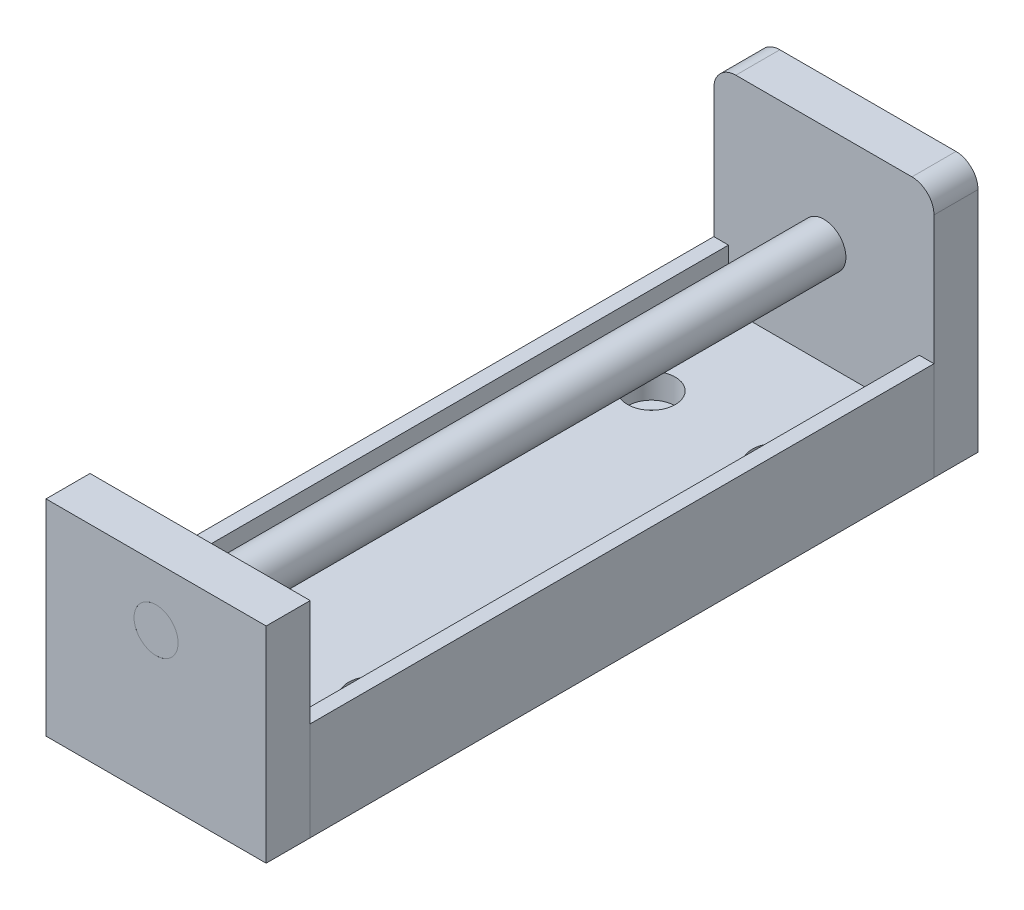
ISO-10303-21;
HEADER;
FILE_DESCRIPTION(('STEP AP214'),'2;1');
FILE_NAME('part.step','',(''),(''),'','','');
FILE_SCHEMA(('AUTOMOTIVE_DESIGN { 1 0 10303 214 1 1 1 1 }'));
ENDSEC;
DATA;
#1=APPLICATION_CONTEXT('core data for automotive mechanical design processes');
#2=APPLICATION_PROTOCOL_DEFINITION('international standard','automotive_design',2000,#1);
#3=PRODUCT_CONTEXT('',#1,'mechanical');
#4=PRODUCT('Part','Part','',(#3));
#5=PRODUCT_RELATED_PRODUCT_CATEGORY('part','',(#4));
#6=PRODUCT_DEFINITION_FORMATION('','',#4);
#7=PRODUCT_DEFINITION_CONTEXT('part definition',#1,'design');
#8=PRODUCT_DEFINITION('design','',#6,#7);
#9=PRODUCT_DEFINITION_SHAPE('','',#8);
#10=(LENGTH_UNIT() NAMED_UNIT(*) SI_UNIT(.MILLI.,.METRE.));
#11=(NAMED_UNIT(*) PLANE_ANGLE_UNIT() SI_UNIT($,.RADIAN.));
#12=(NAMED_UNIT(*) SI_UNIT($,.STERADIAN.) SOLID_ANGLE_UNIT());
#13=UNCERTAINTY_MEASURE_WITH_UNIT(LENGTH_MEASURE(1.E-05),#10,'distance_accuracy_value','');
#14=(GEOMETRIC_REPRESENTATION_CONTEXT(3) GLOBAL_UNCERTAINTY_ASSIGNED_CONTEXT((#13)) GLOBAL_UNIT_ASSIGNED_CONTEXT((#10,
#11,#12)) REPRESENTATION_CONTEXT('',''));
#15=CARTESIAN_POINT('',(0.,0.,0.));
#16=DIRECTION('',(0.,0.,1.));
#17=DIRECTION('',(1.,0.,0.));
#18=AXIS2_PLACEMENT_3D('',#15,#16,#17);
#19=CARTESIAN_POINT('',(0.,0.,6.51471862576143));
#20=DIRECTION('',(0.,0.,1.));
#21=DIRECTION('',(1.,0.,0.));
#22=AXIS2_PLACEMENT_3D('',#19,#20,#21);
#23=CYLINDRICAL_SURFACE('',#22,3.);
#24=CARTESIAN_POINT('',(0.,0.,15.));
#25=DIRECTION('',(0.,0.,1.));
#26=DIRECTION('',(1.,0.,0.));
#27=AXIS2_PLACEMENT_3D('',#24,#25,#26);
#28=CIRCLE('',#27,3.);
#29=CARTESIAN_POINT('',(3.,0.,15.));
#30=VERTEX_POINT('',#29);
#31=EDGE_CURVE('E11',#30,#30,#28,.F.);
#32=ORIENTED_EDGE('',*,*,#31,.F.);
#33=EDGE_LOOP('',(#32));
#34=FACE_BOUND('',#33,.T.);
#35=CARTESIAN_POINT('',(0.,0.,112.));
#36=DIRECTION('',(0.,0.,-1.));
#37=DIRECTION('',(-1.,0.,0.));
#38=AXIS2_PLACEMENT_3D('',#35,#36,#37);
#39=CIRCLE('',#38,3.);
#40=CARTESIAN_POINT('',(-3.,0.,112.));
#41=VERTEX_POINT('',#40);
#42=EDGE_CURVE('E48',#41,#41,#39,.T.);
#43=ORIENTED_EDGE('',*,*,#42,.T.);
#44=EDGE_LOOP('',(#43));
#45=FACE_BOUND('',#44,.T.);
#46=ADVANCED_FACE('F42',(#34,#45),#23,.T.);
#47=CARTESIAN_POINT('',(0.,0.,15.));
#48=DIRECTION('',(0.,0.,1.));
#49=DIRECTION('',(1.,0.,0.));
#50=AXIS2_PLACEMENT_3D('',#47,#48,#49);
#51=PLANE('',#50);
#52=ORIENTED_EDGE('',*,*,#31,.T.);
#53=EDGE_LOOP('',(#52));
#54=FACE_BOUND('',#53,.T.);
#55=ADVANCED_FACE('F57',(#54),#51,.F.);
#56=CARTESIAN_POINT('',(0.,0.,112.));
#57=DIRECTION('',(0.,0.,-1.));
#58=DIRECTION('',(-1.,0.,0.));
#59=AXIS2_PLACEMENT_3D('',#56,#57,#58);
#60=PLANE('',#59);
#61=ORIENTED_EDGE('',*,*,#42,.F.);
#62=EDGE_LOOP('',(#61));
#63=FACE_BOUND('',#62,.T.);
#64=ADVANCED_FACE('F55',(#63),#60,.F.);
#65=CLOSED_SHELL('',(#46,#55,#64));
#66=MANIFOLD_SOLID_BREP('B2',#65);
#67=CARTESIAN_POINT('',(-15.,-20.,112.));
#68=DIRECTION('',(1.,0.,0.));
#69=DIRECTION('',(0.,0.,-1.));
#70=AXIS2_PLACEMENT_3D('',#67,#68,#69);
#71=PLANE('',#70);
#72=DIRECTION('',(0.,-1.,0.));
#73=VECTOR('',#72,1.);
#74=CARTESIAN_POINT('',(-15.,-20.,106.));
#75=LINE('',#74,#73);
#76=CARTESIAN_POINT('',(-15.,8.,106.));
#77=VERTEX_POINT('',#76);
#78=CARTESIAN_POINT('',(-15.,-20.,106.));
#79=VERTEX_POINT('',#78);
#80=EDGE_CURVE('E158',#77,#79,#75,.T.);
#81=ORIENTED_EDGE('',*,*,#80,.T.);
#82=DIRECTION('',(0.,0.,-1.));
#83=VECTOR('',#82,1.);
#84=CARTESIAN_POINT('',(-15.,-20.,112.));
#85=LINE('',#84,#83);
#86=CARTESIAN_POINT('',(-15.,-20.,112.));
#87=VERTEX_POINT('',#86);
#88=EDGE_CURVE('E40',#87,#79,#85,.T.);
#89=ORIENTED_EDGE('',*,*,#88,.F.);
#90=DIRECTION('',(0.,-1.,0.));
#91=VECTOR('',#90,1.);
#92=CARTESIAN_POINT('',(-15.,-20.,112.));
#93=LINE('',#92,#91);
#94=CARTESIAN_POINT('',(-15.,8.,112.));
#95=VERTEX_POINT('',#94);
#96=EDGE_CURVE('E145',#95,#87,#93,.T.);
#97=ORIENTED_EDGE('',*,*,#96,.F.);
#98=DIRECTION('',(0.,0.,-1.));
#99=VECTOR('',#98,1.);
#100=CARTESIAN_POINT('',(-15.,8.,112.));
#101=LINE('',#100,#99);
#102=EDGE_CURVE('E154',#95,#77,#101,.T.);
#103=ORIENTED_EDGE('',*,*,#102,.T.);
#104=EDGE_LOOP('',(#81,#89,#97,#103));
#105=FACE_BOUND('',#104,.T.);
#106=ADVANCED_FACE('F93',(#105),#71,.F.);
#107=CARTESIAN_POINT('',(-15.,-20.,112.));
#108=DIRECTION('',(0.,1.,0.));
#109=DIRECTION('',(0.,0.,1.));
#110=AXIS2_PLACEMENT_3D('',#107,#108,#109);
#111=PLANE('',#110);
#112=DIRECTION('',(1.,0.,0.));
#113=VECTOR('',#112,1.);
#114=CARTESIAN_POINT('',(-15.,-20.,106.));
#115=LINE('',#114,#113);
#116=CARTESIAN_POINT('',(15.,-20.,106.));
#117=VERTEX_POINT('',#116);
#118=EDGE_CURVE('E149',#79,#117,#115,.T.);
#119=ORIENTED_EDGE('',*,*,#118,.T.);
#120=DIRECTION('',(0.,0.,-1.));
#121=VECTOR('',#120,1.);
#122=CARTESIAN_POINT('',(15.,-20.,112.));
#123=LINE('',#122,#121);
#124=CARTESIAN_POINT('',(15.,-20.,112.));
#125=VERTEX_POINT('',#124);
#126=EDGE_CURVE('E102',#125,#117,#123,.T.);
#127=ORIENTED_EDGE('',*,*,#126,.F.);
#128=DIRECTION('',(1.,0.,0.));
#129=VECTOR('',#128,1.);
#130=CARTESIAN_POINT('',(-15.,-20.,112.));
#131=LINE('',#130,#129);
#132=EDGE_CURVE('E140',#87,#125,#131,.T.);
#133=ORIENTED_EDGE('',*,*,#132,.F.);
#134=ORIENTED_EDGE('',*,*,#88,.T.);
#135=EDGE_LOOP('',(#119,#127,#133,#134));
#136=FACE_BOUND('',#135,.T.);
#137=ADVANCED_FACE('F148',(#136),#111,.F.);
#138=CARTESIAN_POINT('',(15.,-20.,112.));
#139=DIRECTION('',(-1.,0.,0.));
#140=DIRECTION('',(0.,0.,1.));
#141=AXIS2_PLACEMENT_3D('',#138,#139,#140);
#142=PLANE('',#141);
#143=DIRECTION('',(0.,1.,0.));
#144=VECTOR('',#143,1.);
#145=CARTESIAN_POINT('',(15.,-20.,106.));
#146=LINE('',#145,#144);
#147=CARTESIAN_POINT('',(15.,8.,106.));
#148=VERTEX_POINT('',#147);
#149=EDGE_CURVE('E127',#117,#148,#146,.T.);
#150=ORIENTED_EDGE('',*,*,#149,.T.);
#151=DIRECTION('',(0.,0.,-1.));
#152=VECTOR('',#151,1.);
#153=CARTESIAN_POINT('',(15.,8.,112.));
#154=LINE('',#153,#152);
#155=CARTESIAN_POINT('',(15.,8.,112.));
#156=VERTEX_POINT('',#155);
#157=EDGE_CURVE('E150',#156,#148,#154,.T.);
#158=ORIENTED_EDGE('',*,*,#157,.F.);
#159=DIRECTION('',(0.,1.,0.));
#160=VECTOR('',#159,1.);
#161=CARTESIAN_POINT('',(15.,-20.,112.));
#162=LINE('',#161,#160);
#163=EDGE_CURVE('E143',#125,#156,#162,.T.);
#164=ORIENTED_EDGE('',*,*,#163,.F.);
#165=ORIENTED_EDGE('',*,*,#126,.T.);
#166=EDGE_LOOP('',(#150,#158,#164,#165));
#167=FACE_BOUND('',#166,.T.);
#168=ADVANCED_FACE('F152',(#167),#142,.F.);
#169=CARTESIAN_POINT('',(-15.,8.,112.));
#170=DIRECTION('',(0.,-1.,0.));
#171=DIRECTION('',(0.,0.,-1.));
#172=AXIS2_PLACEMENT_3D('',#169,#170,#171);
#173=PLANE('',#172);
#174=DIRECTION('',(-1.,0.,0.));
#175=VECTOR('',#174,1.);
#176=CARTESIAN_POINT('',(-15.,8.,106.));
#177=LINE('',#176,#175);
#178=EDGE_CURVE('E133',#148,#77,#177,.T.);
#179=ORIENTED_EDGE('',*,*,#178,.T.);
#180=ORIENTED_EDGE('',*,*,#102,.F.);
#181=DIRECTION('',(-1.,0.,0.));
#182=VECTOR('',#181,1.);
#183=CARTESIAN_POINT('',(-15.,8.,112.));
#184=LINE('',#183,#182);
#185=EDGE_CURVE('E110',#156,#95,#184,.T.);
#186=ORIENTED_EDGE('',*,*,#185,.F.);
#187=ORIENTED_EDGE('',*,*,#157,.T.);
#188=EDGE_LOOP('',(#179,#180,#186,#187));
#189=FACE_BOUND('',#188,.T.);
#190=ADVANCED_FACE('F165',(#189),#173,.F.);
#191=CARTESIAN_POINT('',(0.,0.,112.));
#192=DIRECTION('',(0.,0.,-1.));
#193=DIRECTION('',(-1.,0.,0.));
#194=AXIS2_PLACEMENT_3D('',#191,#192,#193);
#195=PLANE('',#194);
#196=CARTESIAN_POINT('',(0.,0.,112.));
#197=DIRECTION('',(0.,0.,1.));
#198=DIRECTION('',(1.,0.,0.));
#199=AXIS2_PLACEMENT_3D('',#196,#197,#198);
#200=CIRCLE('',#199,3.);
#201=CARTESIAN_POINT('',(3.,0.,112.));
#202=VERTEX_POINT('',#201);
#203=EDGE_CURVE('E171',#202,#202,#200,.T.);
#204=ORIENTED_EDGE('',*,*,#203,.F.);
#205=EDGE_LOOP('',(#204));
#206=FACE_BOUND('',#205,.T.);
#207=ORIENTED_EDGE('',*,*,#96,.T.);
#208=ORIENTED_EDGE('',*,*,#132,.T.);
#209=ORIENTED_EDGE('',*,*,#163,.T.);
#210=ORIENTED_EDGE('',*,*,#185,.T.);
#211=EDGE_LOOP('',(#207,#208,#209,#210));
#212=FACE_BOUND('',#211,.T.);
#213=ADVANCED_FACE('F141',(#206,#212),#195,.F.);
#214=CARTESIAN_POINT('',(0.,0.,106.));
#215=DIRECTION('',(0.,0.,-1.));
#216=DIRECTION('',(-1.,0.,0.));
#217=AXIS2_PLACEMENT_3D('',#214,#215,#216);
#218=PLANE('',#217);
#219=CARTESIAN_POINT('',(0.,0.,106.));
#220=DIRECTION('',(0.,0.,-1.));
#221=DIRECTION('',(-1.,0.,0.));
#222=AXIS2_PLACEMENT_3D('',#219,#220,#221);
#223=CIRCLE('',#222,3.);
#224=CARTESIAN_POINT('',(-3.,0.,106.));
#225=VERTEX_POINT('',#224);
#226=EDGE_CURVE('E96',#225,#225,#223,.T.);
#227=ORIENTED_EDGE('',*,*,#226,.F.);
#228=EDGE_LOOP('',(#227));
#229=FACE_BOUND('',#228,.T.);
#230=ORIENTED_EDGE('',*,*,#80,.F.);
#231=ORIENTED_EDGE('',*,*,#178,.F.);
#232=ORIENTED_EDGE('',*,*,#149,.F.);
#233=ORIENTED_EDGE('',*,*,#118,.F.);
#234=EDGE_LOOP('',(#230,#231,#232,#233));
#235=FACE_BOUND('',#234,.T.);
#236=ADVANCED_FACE('F168',(#229,#235),#218,.T.);
#237=CARTESIAN_POINT('',(0.,0.,15.));
#238=DIRECTION('',(0.,0.,1.));
#239=DIRECTION('',(1.,0.,0.));
#240=AXIS2_PLACEMENT_3D('',#237,#238,#239);
#241=CYLINDRICAL_SURFACE('',#240,3.);
#242=ORIENTED_EDGE('',*,*,#226,.T.);
#243=EDGE_LOOP('',(#242));
#244=FACE_BOUND('',#243,.T.);
#245=ORIENTED_EDGE('',*,*,#203,.T.);
#246=EDGE_LOOP('',(#245));
#247=FACE_BOUND('',#246,.T.);
#248=ADVANCED_FACE('F178',(#244,#247),#241,.F.);
#249=CLOSED_SHELL('',(#106,#137,#168,#190,#213,#236,#248));
#250=MANIFOLD_SOLID_BREP('B6',#249);
#251=CARTESIAN_POINT('',(-15.,-20.,106.));
#252=DIRECTION('',(1.,0.,0.));
#253=DIRECTION('',(0.,1.,0.));
#254=AXIS2_PLACEMENT_3D('',#251,#252,#253);
#255=PLANE('',#254);
#256=DIRECTION('',(0.,-1.,0.));
#257=VECTOR('',#256,1.);
#258=CARTESIAN_POINT('',(-15.,-20.,21.));
#259=LINE('',#258,#257);
#260=CARTESIAN_POINT('',(-15.,-6.55,21.));
#261=VERTEX_POINT('',#260);
#262=CARTESIAN_POINT('',(-15.,-20.,21.));
#263=VERTEX_POINT('',#262);
#264=EDGE_CURVE('E343',#261,#263,#259,.T.);
#265=ORIENTED_EDGE('',*,*,#264,.T.);
#266=DIRECTION('',(0.,0.,-1.));
#267=VECTOR('',#266,1.);
#268=CARTESIAN_POINT('',(-15.,-20.,106.));
#269=LINE('',#268,#267);
#270=CARTESIAN_POINT('',(-15.,-20.,106.));
#271=VERTEX_POINT('',#270);
#272=EDGE_CURVE('E91',#271,#263,#269,.T.);
#273=ORIENTED_EDGE('',*,*,#272,.F.);
#274=DIRECTION('',(0.,-1.,0.));
#275=VECTOR('',#274,1.);
#276=CARTESIAN_POINT('',(-15.,-20.,106.));
#277=LINE('',#276,#275);
#278=CARTESIAN_POINT('',(-15.,-6.55,106.));
#279=VERTEX_POINT('',#278);
#280=EDGE_CURVE('E358',#279,#271,#277,.T.);
#281=ORIENTED_EDGE('',*,*,#280,.F.);
#282=DIRECTION('',(0.,0.,-1.));
#283=VECTOR('',#282,1.);
#284=CARTESIAN_POINT('',(-15.,-6.55,106.));
#285=LINE('',#284,#283);
#286=EDGE_CURVE('E339',#279,#261,#285,.T.);
#287=ORIENTED_EDGE('',*,*,#286,.T.);
#288=EDGE_LOOP('',(#265,#273,#281,#287));
#289=FACE_BOUND('',#288,.T.);
#290=ADVANCED_FACE('F247',(#289),#255,.F.);
#291=CARTESIAN_POINT('',(15.,-20.,106.));
#292=DIRECTION('',(0.,1.,0.));
#293=DIRECTION('',(0.,0.,1.));
#294=AXIS2_PLACEMENT_3D('',#291,#292,#293);
#295=PLANE('',#294);
#296=CARTESIAN_POINT('',(-8.5,-20.,36.));
#297=DIRECTION('',(0.,1.,0.));
#298=DIRECTION('',(0.,0.,1.));
#299=AXIS2_PLACEMENT_3D('',#296,#297,#298);
#300=CIRCLE('',#299,1.6);
#301=CARTESIAN_POINT('',(-8.5,-20.,37.6));
#302=VERTEX_POINT('',#301);
#303=EDGE_CURVE('E426',#302,#302,#300,.T.);
#304=ORIENTED_EDGE('',*,*,#303,.T.);
#305=EDGE_LOOP('',(#304));
#306=FACE_BOUND('',#305,.T.);
#307=CARTESIAN_POINT('',(8.50000000000001,-20.,36.));
#308=DIRECTION('',(0.,1.,0.));
#309=DIRECTION('',(0.,0.,1.));
#310=AXIS2_PLACEMENT_3D('',#307,#308,#309);
#311=CIRCLE('',#310,1.6);
#312=CARTESIAN_POINT('',(8.50000000000001,-20.,37.6));
#313=VERTEX_POINT('',#312);
#314=EDGE_CURVE('E414',#313,#313,#311,.T.);
#315=ORIENTED_EDGE('',*,*,#314,.T.);
#316=EDGE_LOOP('',(#315));
#317=FACE_BOUND('',#316,.T.);
#318=CARTESIAN_POINT('',(8.50000000000001,-20.,91.));
#319=DIRECTION('',(0.,1.,0.));
#320=DIRECTION('',(0.,0.,1.));
#321=AXIS2_PLACEMENT_3D('',#318,#319,#320);
#322=CIRCLE('',#321,1.6);
#323=CARTESIAN_POINT('',(8.50000000000001,-20.,92.6));
#324=VERTEX_POINT('',#323);
#325=EDGE_CURVE('E402',#324,#324,#322,.T.);
#326=ORIENTED_EDGE('',*,*,#325,.T.);
#327=EDGE_LOOP('',(#326));
#328=FACE_BOUND('',#327,.T.);
#329=CARTESIAN_POINT('',(-8.49999999999999,-20.,91.));
#330=DIRECTION('',(0.,1.,0.));
#331=DIRECTION('',(0.,0.,1.));
#332=AXIS2_PLACEMENT_3D('',#329,#330,#331);
#333=CIRCLE('',#332,1.6);
#334=CARTESIAN_POINT('',(-8.49999999999999,-20.,92.6));
#335=VERTEX_POINT('',#334);
#336=EDGE_CURVE('E347',#335,#335,#333,.T.);
#337=ORIENTED_EDGE('',*,*,#336,.T.);
#338=EDGE_LOOP('',(#337));
#339=FACE_BOUND('',#338,.T.);
#340=DIRECTION('',(1.,0.,0.));
#341=VECTOR('',#340,1.);
#342=CARTESIAN_POINT('',(15.,-20.,21.));
#343=LINE('',#342,#341);
#344=CARTESIAN_POINT('',(15.,-20.,21.));
#345=VERTEX_POINT('',#344);
#346=EDGE_CURVE('E346',#263,#345,#343,.T.);
#347=ORIENTED_EDGE('',*,*,#346,.T.);
#348=DIRECTION('',(0.,0.,-1.));
#349=VECTOR('',#348,1.);
#350=CARTESIAN_POINT('',(15.,-20.,106.));
#351=LINE('',#350,#349);
#352=CARTESIAN_POINT('',(15.,-20.,106.));
#353=VERTEX_POINT('',#352);
#354=EDGE_CURVE('E255',#353,#345,#351,.T.);
#355=ORIENTED_EDGE('',*,*,#354,.F.);
#356=DIRECTION('',(1.,0.,0.));
#357=VECTOR('',#356,1.);
#358=CARTESIAN_POINT('',(15.,-20.,106.));
#359=LINE('',#358,#357);
#360=EDGE_CURVE('E306',#271,#353,#359,.T.);
#361=ORIENTED_EDGE('',*,*,#360,.F.);
#362=ORIENTED_EDGE('',*,*,#272,.T.);
#363=EDGE_LOOP('',(#347,#355,#361,#362));
#364=FACE_BOUND('',#363,.T.);
#365=ADVANCED_FACE('F468',(#306,#317,#328,#339,#364),#295,.F.);
#366=CARTESIAN_POINT('',(15.,-6.55,106.));
#367=DIRECTION('',(-1.,0.,0.));
#368=DIRECTION('',(0.,0.,1.));
#369=AXIS2_PLACEMENT_3D('',#366,#367,#368);
#370=PLANE('',#369);
#371=DIRECTION('',(0.,1.,0.));
#372=VECTOR('',#371,1.);
#373=CARTESIAN_POINT('',(15.,-6.55,21.));
#374=LINE('',#373,#372);
#375=CARTESIAN_POINT('',(15.,-6.55,21.));
#376=VERTEX_POINT('',#375);
#377=EDGE_CURVE('E349',#345,#376,#374,.T.);
#378=ORIENTED_EDGE('',*,*,#377,.T.);
#379=DIRECTION('',(0.,0.,-1.));
#380=VECTOR('',#379,1.);
#381=CARTESIAN_POINT('',(15.,-6.55,106.));
#382=LINE('',#381,#380);
#383=CARTESIAN_POINT('',(15.,-6.55,106.));
#384=VERTEX_POINT('',#383);
#385=EDGE_CURVE('E365',#384,#376,#382,.T.);
#386=ORIENTED_EDGE('',*,*,#385,.F.);
#387=DIRECTION('',(0.,1.,0.));
#388=VECTOR('',#387,1.);
#389=CARTESIAN_POINT('',(15.,-6.55,106.));
#390=LINE('',#389,#388);
#391=EDGE_CURVE('E373',#353,#384,#390,.T.);
#392=ORIENTED_EDGE('',*,*,#391,.F.);
#393=ORIENTED_EDGE('',*,*,#354,.T.);
#394=EDGE_LOOP('',(#378,#386,#392,#393));
#395=FACE_BOUND('',#394,.T.);
#396=ADVANCED_FACE('F371',(#395),#370,.F.);
#397=CARTESIAN_POINT('',(13.,-6.55,106.));
#398=DIRECTION('',(0.,-1.,0.));
#399=DIRECTION('',(0.,0.,-1.));
#400=AXIS2_PLACEMENT_3D('',#397,#398,#399);
#401=PLANE('',#400);
#402=DIRECTION('',(-1.,0.,0.));
#403=VECTOR('',#402,1.);
#404=CARTESIAN_POINT('',(13.,-6.55,21.));
#405=LINE('',#404,#403);
#406=CARTESIAN_POINT('',(13.,-6.55,21.));
#407=VERTEX_POINT('',#406);
#408=EDGE_CURVE('E351',#376,#407,#405,.T.);
#409=ORIENTED_EDGE('',*,*,#408,.T.);
#410=DIRECTION('',(0.,0.,-1.));
#411=VECTOR('',#410,1.);
#412=CARTESIAN_POINT('',(13.,-6.55,106.));
#413=LINE('',#412,#411);
#414=CARTESIAN_POINT('',(13.,-6.55,106.));
#415=VERTEX_POINT('',#414);
#416=EDGE_CURVE('E362',#415,#407,#413,.T.);
#417=ORIENTED_EDGE('',*,*,#416,.F.);
#418=DIRECTION('',(-1.,0.,0.));
#419=VECTOR('',#418,1.);
#420=CARTESIAN_POINT('',(13.,-6.55,106.));
#421=LINE('',#420,#419);
#422=EDGE_CURVE('E385',#384,#415,#421,.T.);
#423=ORIENTED_EDGE('',*,*,#422,.F.);
#424=ORIENTED_EDGE('',*,*,#385,.T.);
#425=EDGE_LOOP('',(#409,#417,#423,#424));
#426=FACE_BOUND('',#425,.T.);
#427=ADVANCED_FACE('F381',(#426),#401,.F.);
#428=CARTESIAN_POINT('',(13.,-14.,106.));
#429=DIRECTION('',(1.,0.,0.));
#430=DIRECTION('',(0.,1.,0.));
#431=AXIS2_PLACEMENT_3D('',#428,#429,#430);
#432=PLANE('',#431);
#433=DIRECTION('',(0.,-1.,0.));
#434=VECTOR('',#433,1.);
#435=CARTESIAN_POINT('',(13.,-14.,21.));
#436=LINE('',#435,#434);
#437=CARTESIAN_POINT('',(13.,-14.,21.));
#438=VERTEX_POINT('',#437);
#439=EDGE_CURVE('E353',#407,#438,#436,.T.);
#440=ORIENTED_EDGE('',*,*,#439,.T.);
#441=DIRECTION('',(0.,0.,-1.));
#442=VECTOR('',#441,1.);
#443=CARTESIAN_POINT('',(13.,-14.,106.));
#444=LINE('',#443,#442);
#445=CARTESIAN_POINT('',(13.,-14.,106.));
#446=VERTEX_POINT('',#445);
#447=EDGE_CURVE('E334',#446,#438,#444,.T.);
#448=ORIENTED_EDGE('',*,*,#447,.F.);
#449=DIRECTION('',(0.,-1.,0.));
#450=VECTOR('',#449,1.);
#451=CARTESIAN_POINT('',(13.,-14.,106.));
#452=LINE('',#451,#450);
#453=EDGE_CURVE('E325',#415,#446,#452,.T.);
#454=ORIENTED_EDGE('',*,*,#453,.F.);
#455=ORIENTED_EDGE('',*,*,#416,.T.);
#456=EDGE_LOOP('',(#440,#448,#454,#455));
#457=FACE_BOUND('',#456,.T.);
#458=ADVANCED_FACE('F384',(#457),#432,.F.);
#459=CARTESIAN_POINT('',(-13.,-14.,106.));
#460=DIRECTION('',(0.,-1.,0.));
#461=DIRECTION('',(0.,0.,-1.));
#462=AXIS2_PLACEMENT_3D('',#459,#460,#461);
#463=PLANE('',#462);
#464=CARTESIAN_POINT('',(-8.5,-14.,36.));
#465=DIRECTION('',(0.,1.,0.));
#466=DIRECTION('',(0.,0.,1.));
#467=AXIS2_PLACEMENT_3D('',#464,#465,#466);
#468=CIRCLE('',#467,3.25);
#469=CARTESIAN_POINT('',(-8.5,-14.,39.25));
#470=VERTEX_POINT('',#469);
#471=EDGE_CURVE('E435',#470,#470,#468,.T.);
#472=ORIENTED_EDGE('',*,*,#471,.F.);
#473=EDGE_LOOP('',(#472));
#474=FACE_BOUND('',#473,.T.);
#475=CARTESIAN_POINT('',(8.50000000000001,-14.,36.));
#476=DIRECTION('',(0.,1.,0.));
#477=DIRECTION('',(0.,0.,1.));
#478=AXIS2_PLACEMENT_3D('',#475,#476,#477);
#479=CIRCLE('',#478,3.25);
#480=CARTESIAN_POINT('',(8.50000000000001,-14.,39.25));
#481=VERTEX_POINT('',#480);
#482=EDGE_CURVE('E423',#481,#481,#479,.T.);
#483=ORIENTED_EDGE('',*,*,#482,.F.);
#484=EDGE_LOOP('',(#483));
#485=FACE_BOUND('',#484,.T.);
#486=CARTESIAN_POINT('',(8.50000000000001,-14.,91.));
#487=DIRECTION('',(0.,1.,0.));
#488=DIRECTION('',(0.,0.,1.));
#489=AXIS2_PLACEMENT_3D('',#486,#487,#488);
#490=CIRCLE('',#489,3.25);
#491=CARTESIAN_POINT('',(8.50000000000001,-14.,94.25));
#492=VERTEX_POINT('',#491);
#493=EDGE_CURVE('E411',#492,#492,#490,.T.);
#494=ORIENTED_EDGE('',*,*,#493,.F.);
#495=EDGE_LOOP('',(#494));
#496=FACE_BOUND('',#495,.T.);
#497=CARTESIAN_POINT('',(-8.49999999999999,-14.,91.));
#498=DIRECTION('',(0.,1.,0.));
#499=DIRECTION('',(0.,0.,1.));
#500=AXIS2_PLACEMENT_3D('',#497,#498,#499);
#501=CIRCLE('',#500,3.25);
#502=CARTESIAN_POINT('',(-8.49999999999999,-14.,94.25));
#503=VERTEX_POINT('',#502);
#504=EDGE_CURVE('E399',#503,#503,#501,.T.);
#505=ORIENTED_EDGE('',*,*,#504,.F.);
#506=EDGE_LOOP('',(#505));
#507=FACE_BOUND('',#506,.T.);
#508=DIRECTION('',(-1.,0.,0.));
#509=VECTOR('',#508,1.);
#510=CARTESIAN_POINT('',(-13.,-14.,21.));
#511=LINE('',#510,#509);
#512=CARTESIAN_POINT('',(-13.,-14.,21.));
#513=VERTEX_POINT('',#512);
#514=EDGE_CURVE('E333',#438,#513,#511,.T.);
#515=ORIENTED_EDGE('',*,*,#514,.T.);
#516=DIRECTION('',(0.,0.,-1.));
#517=VECTOR('',#516,1.);
#518=CARTESIAN_POINT('',(-13.,-14.,106.));
#519=LINE('',#518,#517);
#520=CARTESIAN_POINT('',(-13.,-14.,106.));
#521=VERTEX_POINT('',#520);
#522=EDGE_CURVE('E330',#521,#513,#519,.T.);
#523=ORIENTED_EDGE('',*,*,#522,.F.);
#524=DIRECTION('',(-1.,0.,0.));
#525=VECTOR('',#524,1.);
#526=CARTESIAN_POINT('',(-13.,-14.,106.));
#527=LINE('',#526,#525);
#528=EDGE_CURVE('E319',#446,#521,#527,.T.);
#529=ORIENTED_EDGE('',*,*,#528,.F.);
#530=ORIENTED_EDGE('',*,*,#447,.T.);
#531=EDGE_LOOP('',(#515,#523,#529,#530));
#532=FACE_BOUND('',#531,.T.);
#533=ADVANCED_FACE('F331',(#474,#485,#496,#507,#532),#463,.F.);
#534=CARTESIAN_POINT('',(-13.,-6.55,106.));
#535=DIRECTION('',(-1.,0.,0.));
#536=DIRECTION('',(0.,-1.,0.));
#537=AXIS2_PLACEMENT_3D('',#534,#535,#536);
#538=PLANE('',#537);
#539=DIRECTION('',(0.,1.,0.));
#540=VECTOR('',#539,1.);
#541=CARTESIAN_POINT('',(-13.,-6.55,21.));
#542=LINE('',#541,#540);
#543=CARTESIAN_POINT('',(-13.,-6.55,21.));
#544=VERTEX_POINT('',#543);
#545=EDGE_CURVE('E292',#513,#544,#542,.T.);
#546=ORIENTED_EDGE('',*,*,#545,.T.);
#547=DIRECTION('',(0.,0.,-1.));
#548=VECTOR('',#547,1.);
#549=CARTESIAN_POINT('',(-13.,-6.55,106.));
#550=LINE('',#549,#548);
#551=CARTESIAN_POINT('',(-13.,-6.55,106.));
#552=VERTEX_POINT('',#551);
#553=EDGE_CURVE('E335',#552,#544,#550,.T.);
#554=ORIENTED_EDGE('',*,*,#553,.F.);
#555=DIRECTION('',(0.,1.,0.));
#556=VECTOR('',#555,1.);
#557=CARTESIAN_POINT('',(-13.,-6.55,106.));
#558=LINE('',#557,#556);
#559=EDGE_CURVE('E323',#521,#552,#558,.T.);
#560=ORIENTED_EDGE('',*,*,#559,.F.);
#561=ORIENTED_EDGE('',*,*,#522,.T.);
#562=EDGE_LOOP('',(#546,#554,#560,#561));
#563=FACE_BOUND('',#562,.T.);
#564=ADVANCED_FACE('F337',(#563),#538,.F.);
#565=CARTESIAN_POINT('',(-15.,-6.55,106.));
#566=DIRECTION('',(0.,-1.,0.));
#567=DIRECTION('',(0.,0.,-1.));
#568=AXIS2_PLACEMENT_3D('',#565,#566,#567);
#569=PLANE('',#568);
#570=DIRECTION('',(-1.,0.,0.));
#571=VECTOR('',#570,1.);
#572=CARTESIAN_POINT('',(-15.,-6.55,21.));
#573=LINE('',#572,#571);
#574=EDGE_CURVE('E298',#544,#261,#573,.T.);
#575=ORIENTED_EDGE('',*,*,#574,.T.);
#576=ORIENTED_EDGE('',*,*,#286,.F.);
#577=DIRECTION('',(-1.,0.,0.));
#578=VECTOR('',#577,1.);
#579=CARTESIAN_POINT('',(-15.,-6.55,106.));
#580=LINE('',#579,#578);
#581=EDGE_CURVE('E263',#552,#279,#580,.T.);
#582=ORIENTED_EDGE('',*,*,#581,.F.);
#583=ORIENTED_EDGE('',*,*,#553,.T.);
#584=EDGE_LOOP('',(#575,#576,#582,#583));
#585=FACE_BOUND('',#584,.T.);
#586=ADVANCED_FACE('F476',(#585),#569,.F.);
#587=CARTESIAN_POINT('',(0.,0.,106.));
#588=DIRECTION('',(0.,0.,-1.));
#589=DIRECTION('',(-1.,0.,0.));
#590=AXIS2_PLACEMENT_3D('',#587,#588,#589);
#591=PLANE('',#590);
#592=ORIENTED_EDGE('',*,*,#280,.T.);
#593=ORIENTED_EDGE('',*,*,#360,.T.);
#594=ORIENTED_EDGE('',*,*,#391,.T.);
#595=ORIENTED_EDGE('',*,*,#422,.T.);
#596=ORIENTED_EDGE('',*,*,#453,.T.);
#597=ORIENTED_EDGE('',*,*,#528,.T.);
#598=ORIENTED_EDGE('',*,*,#559,.T.);
#599=ORIENTED_EDGE('',*,*,#581,.T.);
#600=EDGE_LOOP('',(#592,#593,#594,#595,#596,#597,#598,#599));
#601=FACE_BOUND('',#600,.T.);
#602=ADVANCED_FACE('F321',(#601),#591,.F.);
#603=CARTESIAN_POINT('',(0.,0.,21.));
#604=DIRECTION('',(0.,0.,-1.));
#605=DIRECTION('',(-1.,0.,0.));
#606=AXIS2_PLACEMENT_3D('',#603,#604,#605);
#607=PLANE('',#606);
#608=ORIENTED_EDGE('',*,*,#264,.F.);
#609=ORIENTED_EDGE('',*,*,#574,.F.);
#610=ORIENTED_EDGE('',*,*,#545,.F.);
#611=ORIENTED_EDGE('',*,*,#514,.F.);
#612=ORIENTED_EDGE('',*,*,#439,.F.);
#613=ORIENTED_EDGE('',*,*,#408,.F.);
#614=ORIENTED_EDGE('',*,*,#377,.F.);
#615=ORIENTED_EDGE('',*,*,#346,.F.);
#616=EDGE_LOOP('',(#608,#609,#610,#611,#612,#613,#614,#615));
#617=FACE_BOUND('',#616,.T.);
#618=ADVANCED_FACE('F377',(#617),#607,.T.);
#619=CARTESIAN_POINT('',(-8.49999999999999,-14.,91.));
#620=DIRECTION('',(0.,1.,0.));
#621=DIRECTION('',(0.,0.,1.));
#622=AXIS2_PLACEMENT_3D('',#619,#620,#621);
#623=CYLINDRICAL_SURFACE('',#622,1.6);
#624=ORIENTED_EDGE('',*,*,#336,.F.);
#625=EDGE_LOOP('',(#624));
#626=FACE_BOUND('',#625,.T.);
#627=CARTESIAN_POINT('',(-8.49999999999999,-17.4,91.));
#628=DIRECTION('',(0.,1.,0.));
#629=DIRECTION('',(0.,0.,1.));
#630=AXIS2_PLACEMENT_3D('',#627,#628,#629);
#631=CIRCLE('',#630,1.6);
#632=CARTESIAN_POINT('',(-8.49999999999999,-17.4,92.6));
#633=VERTEX_POINT('',#632);
#634=EDGE_CURVE('E393',#633,#633,#631,.T.);
#635=ORIENTED_EDGE('',*,*,#634,.T.);
#636=EDGE_LOOP('',(#635));
#637=FACE_BOUND('',#636,.T.);
#638=ADVANCED_FACE('F463',(#626,#637),#623,.F.);
#639=CARTESIAN_POINT('',(-6.89999999999999,-17.4,91.));
#640=DIRECTION('',(0.,-1.,0.));
#641=DIRECTION('',(0.,0.,-1.));
#642=AXIS2_PLACEMENT_3D('',#639,#640,#641);
#643=PLANE('',#642);
#644=ORIENTED_EDGE('',*,*,#634,.F.);
#645=EDGE_LOOP('',(#644));
#646=FACE_BOUND('',#645,.T.);
#647=CARTESIAN_POINT('',(-8.49999999999999,-17.4,91.));
#648=DIRECTION('',(0.,1.,0.));
#649=DIRECTION('',(0.,0.,1.));
#650=AXIS2_PLACEMENT_3D('',#647,#648,#649);
#651=CIRCLE('',#650,3.25);
#652=CARTESIAN_POINT('',(-8.49999999999999,-17.4,94.25));
#653=VERTEX_POINT('',#652);
#654=EDGE_CURVE('E396',#653,#653,#651,.T.);
#655=ORIENTED_EDGE('',*,*,#654,.T.);
#656=EDGE_LOOP('',(#655));
#657=FACE_BOUND('',#656,.T.);
#658=ADVANCED_FACE('F453',(#646,#657),#643,.F.);
#659=CARTESIAN_POINT('',(-8.49999999999999,-14.,91.));
#660=DIRECTION('',(0.,1.,0.));
#661=DIRECTION('',(0.,0.,1.));
#662=AXIS2_PLACEMENT_3D('',#659,#660,#661);
#663=CYLINDRICAL_SURFACE('',#662,3.25);
#664=ORIENTED_EDGE('',*,*,#654,.F.);
#665=EDGE_LOOP('',(#664));
#666=FACE_BOUND('',#665,.T.);
#667=ORIENTED_EDGE('',*,*,#504,.T.);
#668=EDGE_LOOP('',(#667));
#669=FACE_BOUND('',#668,.T.);
#670=ADVANCED_FACE('F450',(#666,#669),#663,.F.);
#671=CARTESIAN_POINT('',(8.50000000000001,-14.,91.));
#672=DIRECTION('',(0.,1.,0.));
#673=DIRECTION('',(0.,0.,1.));
#674=AXIS2_PLACEMENT_3D('',#671,#672,#673);
#675=CYLINDRICAL_SURFACE('',#674,1.6);
#676=ORIENTED_EDGE('',*,*,#325,.F.);
#677=EDGE_LOOP('',(#676));
#678=FACE_BOUND('',#677,.T.);
#679=CARTESIAN_POINT('',(8.50000000000001,-17.4,91.));
#680=DIRECTION('',(0.,1.,0.));
#681=DIRECTION('',(0.,0.,1.));
#682=AXIS2_PLACEMENT_3D('',#679,#680,#681);
#683=CIRCLE('',#682,1.6);
#684=CARTESIAN_POINT('',(8.50000000000001,-17.4,92.6));
#685=VERTEX_POINT('',#684);
#686=EDGE_CURVE('E405',#685,#685,#683,.T.);
#687=ORIENTED_EDGE('',*,*,#686,.T.);
#688=EDGE_LOOP('',(#687));
#689=FACE_BOUND('',#688,.T.);
#690=ADVANCED_FACE('F452',(#678,#689),#675,.F.);
#691=CARTESIAN_POINT('',(10.1,-17.4,91.));
#692=DIRECTION('',(0.,-1.,0.));
#693=DIRECTION('',(0.,0.,-1.));
#694=AXIS2_PLACEMENT_3D('',#691,#692,#693);
#695=PLANE('',#694);
#696=ORIENTED_EDGE('',*,*,#686,.F.);
#697=EDGE_LOOP('',(#696));
#698=FACE_BOUND('',#697,.T.);
#699=CARTESIAN_POINT('',(8.50000000000001,-17.4,91.));
#700=DIRECTION('',(0.,1.,0.));
#701=DIRECTION('',(0.,0.,1.));
#702=AXIS2_PLACEMENT_3D('',#699,#700,#701);
#703=CIRCLE('',#702,3.25);
#704=CARTESIAN_POINT('',(8.50000000000001,-17.4,94.25));
#705=VERTEX_POINT('',#704);
#706=EDGE_CURVE('E408',#705,#705,#703,.T.);
#707=ORIENTED_EDGE('',*,*,#706,.T.);
#708=EDGE_LOOP('',(#707));
#709=FACE_BOUND('',#708,.T.);
#710=ADVANCED_FACE('F460',(#698,#709),#695,.F.);
#711=CARTESIAN_POINT('',(8.50000000000001,-14.,91.));
#712=DIRECTION('',(0.,1.,0.));
#713=DIRECTION('',(0.,0.,1.));
#714=AXIS2_PLACEMENT_3D('',#711,#712,#713);
#715=CYLINDRICAL_SURFACE('',#714,3.25);
#716=ORIENTED_EDGE('',*,*,#706,.F.);
#717=EDGE_LOOP('',(#716));
#718=FACE_BOUND('',#717,.T.);
#719=ORIENTED_EDGE('',*,*,#493,.T.);
#720=EDGE_LOOP('',(#719));
#721=FACE_BOUND('',#720,.T.);
#722=ADVANCED_FACE('F577',(#718,#721),#715,.F.);
#723=CARTESIAN_POINT('',(8.50000000000001,-14.,36.));
#724=DIRECTION('',(0.,1.,0.));
#725=DIRECTION('',(0.,0.,1.));
#726=AXIS2_PLACEMENT_3D('',#723,#724,#725);
#727=CYLINDRICAL_SURFACE('',#726,1.6);
#728=ORIENTED_EDGE('',*,*,#314,.F.);
#729=EDGE_LOOP('',(#728));
#730=FACE_BOUND('',#729,.T.);
#731=CARTESIAN_POINT('',(8.50000000000001,-17.4,36.));
#732=DIRECTION('',(0.,1.,0.));
#733=DIRECTION('',(0.,0.,1.));
#734=AXIS2_PLACEMENT_3D('',#731,#732,#733);
#735=CIRCLE('',#734,1.6);
#736=CARTESIAN_POINT('',(8.50000000000001,-17.4,37.6));
#737=VERTEX_POINT('',#736);
#738=EDGE_CURVE('E417',#737,#737,#735,.T.);
#739=ORIENTED_EDGE('',*,*,#738,.T.);
#740=EDGE_LOOP('',(#739));
#741=FACE_BOUND('',#740,.T.);
#742=ADVANCED_FACE('F587',(#730,#741),#727,.F.);
#743=CARTESIAN_POINT('',(10.1,-17.4,36.));
#744=DIRECTION('',(0.,-1.,0.));
#745=DIRECTION('',(0.,0.,-1.));
#746=AXIS2_PLACEMENT_3D('',#743,#744,#745);
#747=PLANE('',#746);
#748=ORIENTED_EDGE('',*,*,#738,.F.);
#749=EDGE_LOOP('',(#748));
#750=FACE_BOUND('',#749,.T.);
#751=CARTESIAN_POINT('',(8.50000000000001,-17.4,36.));
#752=DIRECTION('',(0.,1.,0.));
#753=DIRECTION('',(0.,0.,1.));
#754=AXIS2_PLACEMENT_3D('',#751,#752,#753);
#755=CIRCLE('',#754,3.25);
#756=CARTESIAN_POINT('',(8.50000000000001,-17.4,39.25));
#757=VERTEX_POINT('',#756);
#758=EDGE_CURVE('E420',#757,#757,#755,.T.);
#759=ORIENTED_EDGE('',*,*,#758,.T.);
#760=EDGE_LOOP('',(#759));
#761=FACE_BOUND('',#760,.T.);
#762=ADVANCED_FACE('F597',(#750,#761),#747,.F.);
#763=CARTESIAN_POINT('',(8.50000000000001,-14.,36.));
#764=DIRECTION('',(0.,1.,0.));
#765=DIRECTION('',(0.,0.,1.));
#766=AXIS2_PLACEMENT_3D('',#763,#764,#765);
#767=CYLINDRICAL_SURFACE('',#766,3.25);
#768=ORIENTED_EDGE('',*,*,#758,.F.);
#769=EDGE_LOOP('',(#768));
#770=FACE_BOUND('',#769,.T.);
#771=ORIENTED_EDGE('',*,*,#482,.T.);
#772=EDGE_LOOP('',(#771));
#773=FACE_BOUND('',#772,.T.);
#774=ADVANCED_FACE('F607',(#770,#773),#767,.F.);
#775=CARTESIAN_POINT('',(-8.5,-14.,36.));
#776=DIRECTION('',(0.,1.,0.));
#777=DIRECTION('',(0.,0.,1.));
#778=AXIS2_PLACEMENT_3D('',#775,#776,#777);
#779=CYLINDRICAL_SURFACE('',#778,1.6);
#780=ORIENTED_EDGE('',*,*,#303,.F.);
#781=EDGE_LOOP('',(#780));
#782=FACE_BOUND('',#781,.T.);
#783=CARTESIAN_POINT('',(-8.5,-17.4,36.));
#784=DIRECTION('',(0.,1.,0.));
#785=DIRECTION('',(0.,0.,1.));
#786=AXIS2_PLACEMENT_3D('',#783,#784,#785);
#787=CIRCLE('',#786,1.6);
#788=CARTESIAN_POINT('',(-8.5,-17.4,37.6));
#789=VERTEX_POINT('',#788);
#790=EDGE_CURVE('E429',#789,#789,#787,.T.);
#791=ORIENTED_EDGE('',*,*,#790,.T.);
#792=EDGE_LOOP('',(#791));
#793=FACE_BOUND('',#792,.T.);
#794=ADVANCED_FACE('F617',(#782,#793),#779,.F.);
#795=CARTESIAN_POINT('',(-6.9,-17.4,36.));
#796=DIRECTION('',(0.,-1.,0.));
#797=DIRECTION('',(0.,0.,-1.));
#798=AXIS2_PLACEMENT_3D('',#795,#796,#797);
#799=PLANE('',#798);
#800=ORIENTED_EDGE('',*,*,#790,.F.);
#801=EDGE_LOOP('',(#800));
#802=FACE_BOUND('',#801,.T.);
#803=CARTESIAN_POINT('',(-8.5,-17.4,36.));
#804=DIRECTION('',(0.,1.,0.));
#805=DIRECTION('',(0.,0.,1.));
#806=AXIS2_PLACEMENT_3D('',#803,#804,#805);
#807=CIRCLE('',#806,3.25);
#808=CARTESIAN_POINT('',(-8.5,-17.4,39.25));
#809=VERTEX_POINT('',#808);
#810=EDGE_CURVE('E432',#809,#809,#807,.T.);
#811=ORIENTED_EDGE('',*,*,#810,.T.);
#812=EDGE_LOOP('',(#811));
#813=FACE_BOUND('',#812,.T.);
#814=ADVANCED_FACE('F627',(#802,#813),#799,.F.);
#815=CARTESIAN_POINT('',(-8.5,-14.,36.));
#816=DIRECTION('',(0.,1.,0.));
#817=DIRECTION('',(0.,0.,1.));
#818=AXIS2_PLACEMENT_3D('',#815,#816,#817);
#819=CYLINDRICAL_SURFACE('',#818,3.25);
#820=ORIENTED_EDGE('',*,*,#810,.F.);
#821=EDGE_LOOP('',(#820));
#822=FACE_BOUND('',#821,.T.);
#823=ORIENTED_EDGE('',*,*,#471,.T.);
#824=EDGE_LOOP('',(#823));
#825=FACE_BOUND('',#824,.T.);
#826=ADVANCED_FACE('F439',(#822,#825),#819,.F.);
#827=CLOSED_SHELL('',(#290,#365,#396,#427,#458,#533,#564,#586,#602,#618,#638,#658,#670,#690,
#710,#722,#742,#762,#774,#794,#814,#826));
#828=MANIFOLD_SOLID_BREP('B34',#827);
#829=CARTESIAN_POINT('',(-15.,14.,21.));
#830=DIRECTION('',(1.,0.,0.));
#831=DIRECTION('',(0.,1.,0.));
#832=AXIS2_PLACEMENT_3D('',#829,#830,#831);
#833=PLANE('',#832);
#834=DIRECTION('',(0.,-1.,0.));
#835=VECTOR('',#834,1.);
#836=CARTESIAN_POINT('',(-15.,14.,21.));
#837=LINE('',#836,#835);
#838=CARTESIAN_POINT('',(-15.,11.,21.));
#839=VERTEX_POINT('',#838);
#840=CARTESIAN_POINT('',(-15.,-20.,21.));
#841=VERTEX_POINT('',#840);
#842=EDGE_CURVE('E732',#839,#841,#837,.T.);
#843=ORIENTED_EDGE('',*,*,#842,.F.);
#844=DIRECTION('',(0.,0.,-1.));
#845=VECTOR('',#844,1.);
#846=CARTESIAN_POINT('',(-15.,11.,21.));
#847=LINE('',#846,#845);
#848=CARTESIAN_POINT('',(-15.,11.,15.));
#849=VERTEX_POINT('',#848);
#850=EDGE_CURVE('E245',#839,#849,#847,.T.);
#851=ORIENTED_EDGE('',*,*,#850,.T.);
#852=DIRECTION('',(0.,-1.,0.));
#853=VECTOR('',#852,1.);
#854=CARTESIAN_POINT('',(-15.,14.,15.));
#855=LINE('',#854,#853);
#856=CARTESIAN_POINT('',(-15.,-20.,15.));
#857=VERTEX_POINT('',#856);
#858=EDGE_CURVE('E751',#849,#857,#855,.T.);
#859=ORIENTED_EDGE('',*,*,#858,.T.);
#860=DIRECTION('',(0.,0.,-1.));
#861=VECTOR('',#860,1.);
#862=CARTESIAN_POINT('',(-15.,-20.,21.));
#863=LINE('',#862,#861);
#864=EDGE_CURVE('E745',#841,#857,#863,.T.);
#865=ORIENTED_EDGE('',*,*,#864,.F.);
#866=EDGE_LOOP('',(#843,#851,#859,#865));
#867=FACE_BOUND('',#866,.T.);
#868=ADVANCED_FACE('F679',(#867),#833,.F.);
#869=CARTESIAN_POINT('',(-15.,-20.,21.));
#870=DIRECTION('',(0.,1.,0.));
#871=DIRECTION('',(0.,0.,1.));
#872=AXIS2_PLACEMENT_3D('',#869,#870,#871);
#873=PLANE('',#872);
#874=DIRECTION('',(1.,0.,0.));
#875=VECTOR('',#874,1.);
#876=CARTESIAN_POINT('',(-15.,-20.,15.));
#877=LINE('',#876,#875);
#878=CARTESIAN_POINT('',(15.,-20.,15.));
#879=VERTEX_POINT('',#878);
#880=EDGE_CURVE('E784',#857,#879,#877,.T.);
#881=ORIENTED_EDGE('',*,*,#880,.T.);
#882=DIRECTION('',(0.,0.,-1.));
#883=VECTOR('',#882,1.);
#884=CARTESIAN_POINT('',(15.,-20.,21.));
#885=LINE('',#884,#883);
#886=CARTESIAN_POINT('',(15.,-20.,21.));
#887=VERTEX_POINT('',#886);
#888=EDGE_CURVE('E747',#887,#879,#885,.T.);
#889=ORIENTED_EDGE('',*,*,#888,.F.);
#890=DIRECTION('',(1.,0.,0.));
#891=VECTOR('',#890,1.);
#892=CARTESIAN_POINT('',(-15.,-20.,21.));
#893=LINE('',#892,#891);
#894=EDGE_CURVE('E735',#841,#887,#893,.T.);
#895=ORIENTED_EDGE('',*,*,#894,.F.);
#896=ORIENTED_EDGE('',*,*,#864,.T.);
#897=EDGE_LOOP('',(#881,#889,#895,#896));
#898=FACE_BOUND('',#897,.T.);
#899=ADVANCED_FACE('F744',(#898),#873,.F.);
#900=CARTESIAN_POINT('',(15.,14.,21.));
#901=DIRECTION('',(-1.,0.,0.));
#902=DIRECTION('',(0.,-1.,0.));
#903=AXIS2_PLACEMENT_3D('',#900,#901,#902);
#904=PLANE('',#903);
#905=DIRECTION('',(0.,1.,0.));
#906=VECTOR('',#905,1.);
#907=CARTESIAN_POINT('',(15.,14.,15.));
#908=LINE('',#907,#906);
#909=CARTESIAN_POINT('',(15.,11.,15.));
#910=VERTEX_POINT('',#909);
#911=EDGE_CURVE('E782',#879,#910,#908,.T.);
#912=ORIENTED_EDGE('',*,*,#911,.T.);
#913=DIRECTION('',(0.,0.,-1.));
#914=VECTOR('',#913,1.);
#915=CARTESIAN_POINT('',(15.,11.,21.));
#916=LINE('',#915,#914);
#917=CARTESIAN_POINT('',(15.,11.,21.));
#918=VERTEX_POINT('',#917);
#919=EDGE_CURVE('E702',#910,#918,#916,.F.);
#920=ORIENTED_EDGE('',*,*,#919,.T.);
#921=DIRECTION('',(0.,1.,0.));
#922=VECTOR('',#921,1.);
#923=CARTESIAN_POINT('',(15.,14.,21.));
#924=LINE('',#923,#922);
#925=EDGE_CURVE('E748',#887,#918,#924,.T.);
#926=ORIENTED_EDGE('',*,*,#925,.F.);
#927=ORIENTED_EDGE('',*,*,#888,.T.);
#928=EDGE_LOOP('',(#912,#920,#926,#927));
#929=FACE_BOUND('',#928,.T.);
#930=ADVANCED_FACE('F783',(#929),#904,.F.);
#931=CARTESIAN_POINT('',(-15.,14.,21.));
#932=DIRECTION('',(0.,-1.,0.));
#933=DIRECTION('',(0.,0.,-1.));
#934=AXIS2_PLACEMENT_3D('',#931,#932,#933);
#935=PLANE('',#934);
#936=DIRECTION('',(-1.,0.,0.));
#937=VECTOR('',#936,1.);
#938=CARTESIAN_POINT('',(-15.,14.,21.));
#939=LINE('',#938,#937);
#940=CARTESIAN_POINT('',(12.,14.,21.));
#941=VERTEX_POINT('',#940);
#942=CARTESIAN_POINT('',(-12.,14.,21.));
#943=VERTEX_POINT('',#942);
#944=EDGE_CURVE('E757',#941,#943,#939,.T.);
#945=ORIENTED_EDGE('',*,*,#944,.F.);
#946=DIRECTION('',(0.,0.,-1.));
#947=VECTOR('',#946,1.);
#948=CARTESIAN_POINT('',(12.,14.,21.));
#949=LINE('',#948,#947);
#950=CARTESIAN_POINT('',(12.,14.,15.));
#951=VERTEX_POINT('',#950);
#952=EDGE_CURVE('E755',#941,#951,#949,.T.);
#953=ORIENTED_EDGE('',*,*,#952,.T.);
#954=DIRECTION('',(-1.,0.,0.));
#955=VECTOR('',#954,1.);
#956=CARTESIAN_POINT('',(-15.,14.,15.));
#957=LINE('',#956,#955);
#958=CARTESIAN_POINT('',(-12.,14.,15.));
#959=VERTEX_POINT('',#958);
#960=EDGE_CURVE('E740',#951,#959,#957,.T.);
#961=ORIENTED_EDGE('',*,*,#960,.T.);
#962=DIRECTION('',(0.,0.,-1.));
#963=VECTOR('',#962,1.);
#964=CARTESIAN_POINT('',(-12.,14.,21.));
#965=LINE('',#964,#963);
#966=EDGE_CURVE('E753',#959,#943,#965,.F.);
#967=ORIENTED_EDGE('',*,*,#966,.T.);
#968=EDGE_LOOP('',(#945,#953,#961,#967));
#969=FACE_BOUND('',#968,.T.);
#970=ADVANCED_FACE('F773',(#969),#935,.F.);
#971=CARTESIAN_POINT('',(0.,0.,21.));
#972=DIRECTION('',(0.,0.,1.));
#973=DIRECTION('',(1.,0.,0.));
#974=AXIS2_PLACEMENT_3D('',#971,#972,#973);
#975=PLANE('',#974);
#976=CARTESIAN_POINT('',(0.,0.,21.));
#977=DIRECTION('',(0.,0.,1.));
#978=DIRECTION('',(1.,0.,0.));
#979=AXIS2_PLACEMENT_3D('',#976,#977,#978);
#980=CIRCLE('',#979,3.);
#981=CARTESIAN_POINT('',(3.,0.,21.));
#982=VERTEX_POINT('',#981);
#983=EDGE_CURVE('E788',#982,#982,#980,.T.);
#984=ORIENTED_EDGE('',*,*,#983,.F.);
#985=EDGE_LOOP('',(#984));
#986=FACE_BOUND('',#985,.T.);
#987=ORIENTED_EDGE('',*,*,#925,.T.);
#988=CARTESIAN_POINT('',(12.,11.,21.));
#989=DIRECTION('',(0.,0.,1.));
#990=DIRECTION('',(1.,0.,0.));
#991=AXIS2_PLACEMENT_3D('',#988,#989,#990);
#992=CIRCLE('',#991,3.);
#993=EDGE_CURVE('E687',#918,#941,#992,.T.);
#994=ORIENTED_EDGE('',*,*,#993,.T.);
#995=ORIENTED_EDGE('',*,*,#944,.T.);
#996=CARTESIAN_POINT('',(-12.,11.,21.));
#997=DIRECTION('',(0.,0.,1.));
#998=DIRECTION('',(1.,0.,0.));
#999=AXIS2_PLACEMENT_3D('',#996,#997,#998);
#1000=CIRCLE('',#999,3.);
#1001=EDGE_CURVE('E694',#943,#839,#1000,.T.);
#1002=ORIENTED_EDGE('',*,*,#1001,.T.);
#1003=ORIENTED_EDGE('',*,*,#842,.T.);
#1004=ORIENTED_EDGE('',*,*,#894,.T.);
#1005=EDGE_LOOP('',(#987,#994,#995,#1002,#1003,#1004));
#1006=FACE_BOUND('',#1005,.T.);
#1007=ADVANCED_FACE('F734',(#986,#1006),#975,.T.);
#1008=CARTESIAN_POINT('',(0.,0.,15.));
#1009=DIRECTION('',(0.,0.,1.));
#1010=DIRECTION('',(1.,0.,0.));
#1011=AXIS2_PLACEMENT_3D('',#1008,#1009,#1010);
#1012=PLANE('',#1011);
#1013=CARTESIAN_POINT('',(0.,0.,15.));
#1014=DIRECTION('',(0.,0.,1.));
#1015=DIRECTION('',(1.,0.,0.));
#1016=AXIS2_PLACEMENT_3D('',#1013,#1014,#1015);
#1017=CIRCLE('',#1016,3.);
#1018=CARTESIAN_POINT('',(3.,0.,15.));
#1019=VERTEX_POINT('',#1018);
#1020=EDGE_CURVE('E793',#1019,#1019,#1017,.T.);
#1021=ORIENTED_EDGE('',*,*,#1020,.T.);
#1022=EDGE_LOOP('',(#1021));
#1023=FACE_BOUND('',#1022,.T.);
#1024=ORIENTED_EDGE('',*,*,#960,.F.);
#1025=CARTESIAN_POINT('',(12.,11.,15.));
#1026=DIRECTION('',(0.,0.,1.));
#1027=DIRECTION('',(1.,0.,0.));
#1028=AXIS2_PLACEMENT_3D('',#1025,#1026,#1027);
#1029=CIRCLE('',#1028,3.);
#1030=EDGE_CURVE('E765',#951,#910,#1029,.F.);
#1031=ORIENTED_EDGE('',*,*,#1030,.T.);
#1032=ORIENTED_EDGE('',*,*,#911,.F.);
#1033=ORIENTED_EDGE('',*,*,#880,.F.);
#1034=ORIENTED_EDGE('',*,*,#858,.F.);
#1035=CARTESIAN_POINT('',(-12.,11.,15.));
#1036=DIRECTION('',(0.,0.,1.));
#1037=DIRECTION('',(1.,0.,0.));
#1038=AXIS2_PLACEMENT_3D('',#1035,#1036,#1037);
#1039=CIRCLE('',#1038,3.);
#1040=EDGE_CURVE('E763',#849,#959,#1039,.F.);
#1041=ORIENTED_EDGE('',*,*,#1040,.T.);
#1042=EDGE_LOOP('',(#1024,#1031,#1032,#1033,#1034,#1041));
#1043=FACE_BOUND('',#1042,.T.);
#1044=ADVANCED_FACE('F781',(#1023,#1043),#1012,.F.);
#1045=CARTESIAN_POINT('',(12.,11.,21.));
#1046=DIRECTION('',(0.,0.,-1.));
#1047=DIRECTION('',(-1.,0.,0.));
#1048=AXIS2_PLACEMENT_3D('',#1045,#1046,#1047);
#1049=CYLINDRICAL_SURFACE('',#1048,3.);
#1050=ORIENTED_EDGE('',*,*,#993,.F.);
#1051=ORIENTED_EDGE('',*,*,#919,.F.);
#1052=ORIENTED_EDGE('',*,*,#1030,.F.);
#1053=ORIENTED_EDGE('',*,*,#952,.F.);
#1054=EDGE_LOOP('',(#1050,#1051,#1052,#1053));
#1055=FACE_BOUND('',#1054,.T.);
#1056=ADVANCED_FACE('F778',(#1055),#1049,.T.);
#1057=CARTESIAN_POINT('',(-12.,11.,21.));
#1058=DIRECTION('',(0.,0.,-1.));
#1059=DIRECTION('',(-1.,0.,0.));
#1060=AXIS2_PLACEMENT_3D('',#1057,#1058,#1059);
#1061=CYLINDRICAL_SURFACE('',#1060,3.);
#1062=ORIENTED_EDGE('',*,*,#1001,.F.);
#1063=ORIENTED_EDGE('',*,*,#966,.F.);
#1064=ORIENTED_EDGE('',*,*,#1040,.F.);
#1065=ORIENTED_EDGE('',*,*,#850,.F.);
#1066=EDGE_LOOP('',(#1062,#1063,#1064,#1065));
#1067=FACE_BOUND('',#1066,.T.);
#1068=ADVANCED_FACE('F681',(#1067),#1061,.T.);
#1069=CARTESIAN_POINT('',(0.,0.,15.));
#1070=DIRECTION('',(0.,0.,1.));
#1071=DIRECTION('',(1.,0.,0.));
#1072=AXIS2_PLACEMENT_3D('',#1069,#1070,#1071);
#1073=CYLINDRICAL_SURFACE('',#1072,3.);
#1074=ORIENTED_EDGE('',*,*,#983,.T.);
#1075=EDGE_LOOP('',(#1074));
#1076=FACE_BOUND('',#1075,.T.);
#1077=ORIENTED_EDGE('',*,*,#1020,.F.);
#1078=EDGE_LOOP('',(#1077));
#1079=FACE_BOUND('',#1078,.T.);
#1080=ADVANCED_FACE('F798',(#1076,#1079),#1073,.F.);
#1081=CLOSED_SHELL('',(#868,#899,#930,#970,#1007,#1044,#1056,#1068,#1080));
#1082=MANIFOLD_SOLID_BREP('B85',#1081);
#1083=ADVANCED_BREP_SHAPE_REPRESENTATION('',(#18,#66,#250,#828,#1082),#14);
#1084=SHAPE_DEFINITION_REPRESENTATION(#9,#1083);
ENDSEC;
END-ISO-10303-21;
